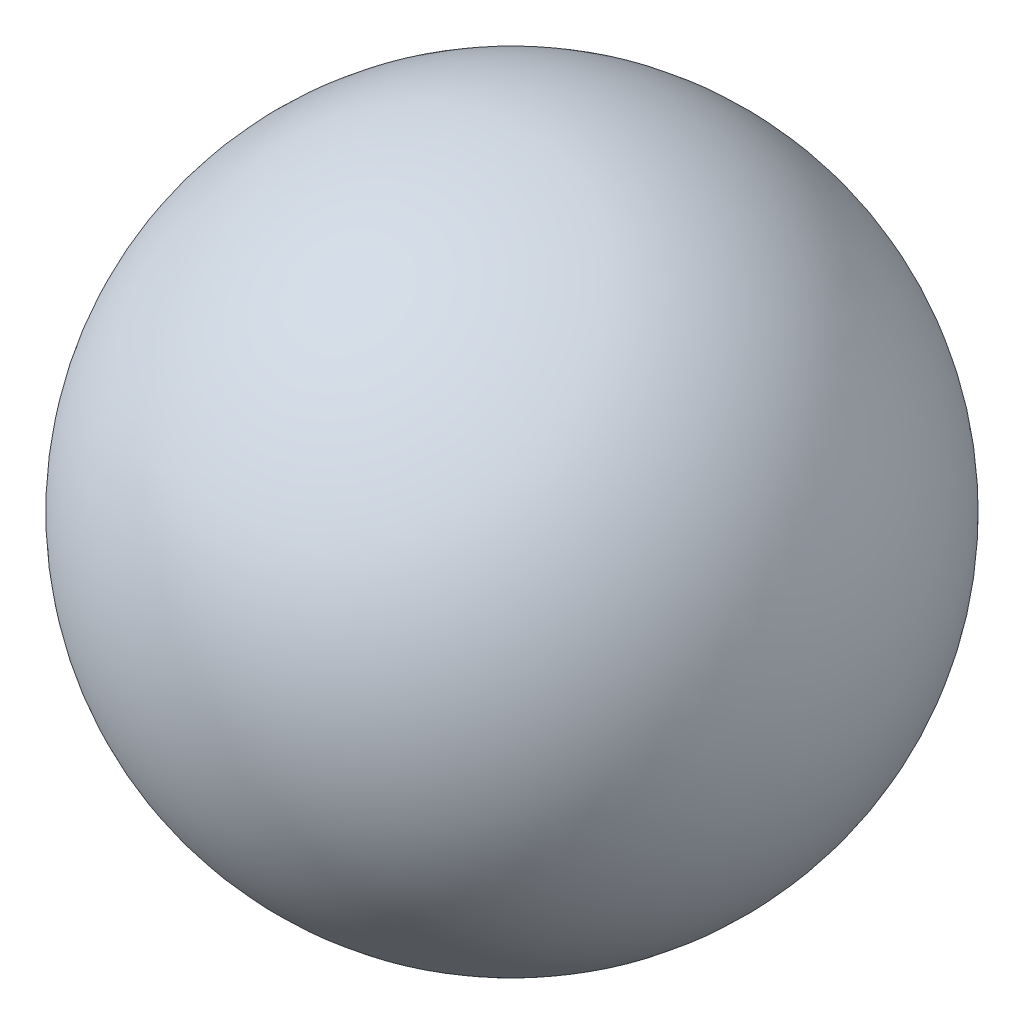
ISO-10303-21;
HEADER;
FILE_DESCRIPTION(('STEP AP214'),'2;1');
FILE_NAME('part.step','',(''),(''),'','','');
FILE_SCHEMA(('AUTOMOTIVE_DESIGN { 1 0 10303 214 1 1 1 1 }'));
ENDSEC;
DATA;
#1=APPLICATION_CONTEXT('core data for automotive mechanical design processes');
#2=APPLICATION_PROTOCOL_DEFINITION('international standard','automotive_design',2000,#1);
#3=PRODUCT_CONTEXT('',#1,'mechanical');
#4=PRODUCT('Part','Part','',(#3));
#5=PRODUCT_RELATED_PRODUCT_CATEGORY('part','',(#4));
#6=PRODUCT_DEFINITION_FORMATION('','',#4);
#7=PRODUCT_DEFINITION_CONTEXT('part definition',#1,'design');
#8=PRODUCT_DEFINITION('design','',#6,#7);
#9=PRODUCT_DEFINITION_SHAPE('','',#8);
#10=(LENGTH_UNIT() NAMED_UNIT(*) SI_UNIT(.MILLI.,.METRE.));
#11=(NAMED_UNIT(*) PLANE_ANGLE_UNIT() SI_UNIT($,.RADIAN.));
#12=(NAMED_UNIT(*) SI_UNIT($,.STERADIAN.) SOLID_ANGLE_UNIT());
#13=UNCERTAINTY_MEASURE_WITH_UNIT(LENGTH_MEASURE(1.E-05),#10,'distance_accuracy_value','');
#14=(GEOMETRIC_REPRESENTATION_CONTEXT(3) GLOBAL_UNCERTAINTY_ASSIGNED_CONTEXT((#13)) GLOBAL_UNIT_ASSIGNED_CONTEXT((#10,
#11,#12)) REPRESENTATION_CONTEXT('',''));
#15=CARTESIAN_POINT('',(0.,0.,0.));
#16=DIRECTION('',(0.,0.,1.));
#17=DIRECTION('',(1.,0.,0.));
#18=AXIS2_PLACEMENT_3D('',#15,#16,#17);
#19=CARTESIAN_POINT('',(0.,0.,0.));
#20=DIRECTION('',(0.,-1.,0.));
#21=DIRECTION('',(-1.,0.,0.));
#22=AXIS2_PLACEMENT_3D('',#19,#20,#21);
#23=SPHERICAL_SURFACE('',#22,12.7);
#24=CARTESIAN_POINT('',(0.,-12.7,0.));
#25=VERTEX_POINT('',#24);
#26=VERTEX_LOOP('',#25);
#27=FACE_BOUND('',#26,.T.);
#28=ADVANCED_FACE('F13',(#27),#23,.T.);
#29=CLOSED_SHELL('',(#28));
#30=MANIFOLD_SOLID_BREP('B1',#29);
#31=ADVANCED_BREP_SHAPE_REPRESENTATION('',(#18,#30),#14);
#32=SHAPE_DEFINITION_REPRESENTATION(#9,#31);
ENDSEC;
END-ISO-10303-21;
